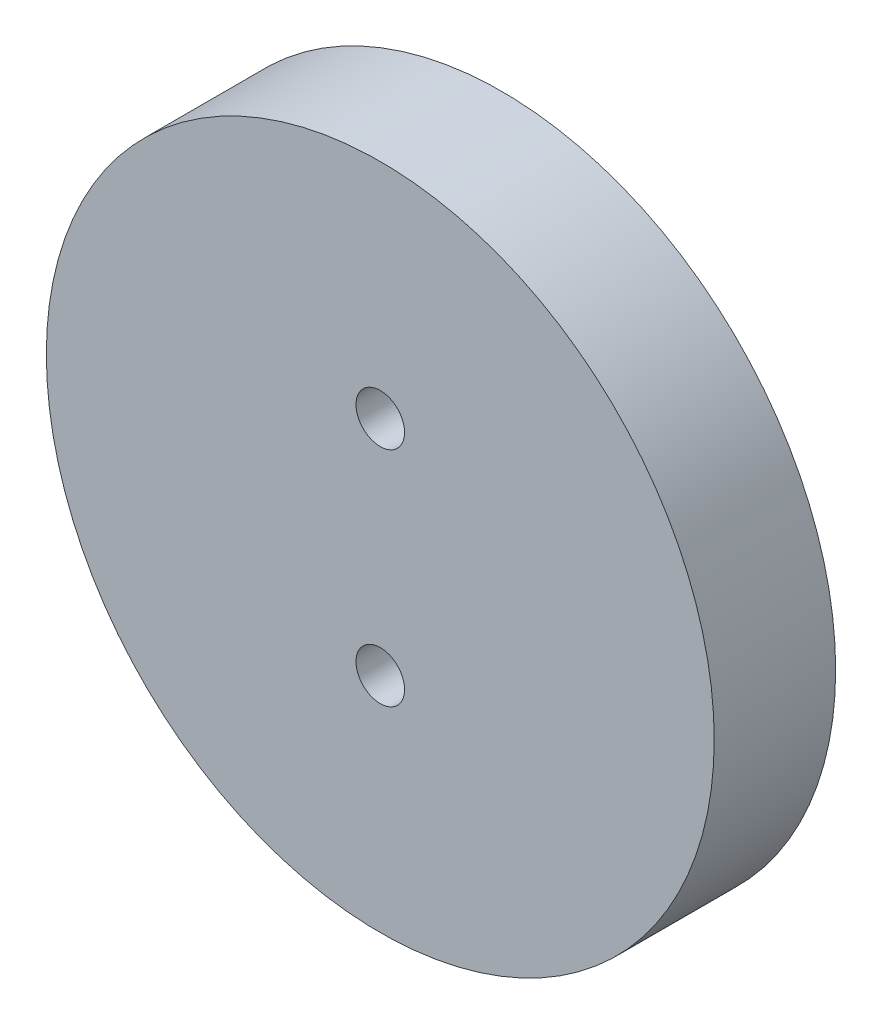
ISO-10303-21;
HEADER;
FILE_DESCRIPTION(('STEP AP214'),'2;1');
FILE_NAME('part.step','',(''),(''),'','','');
FILE_SCHEMA(('AUTOMOTIVE_DESIGN { 1 0 10303 214 1 1 1 1 }'));
ENDSEC;
DATA;
#1=APPLICATION_CONTEXT('core data for automotive mechanical design processes');
#2=APPLICATION_PROTOCOL_DEFINITION('international standard','automotive_design',2000,#1);
#3=PRODUCT_CONTEXT('',#1,'mechanical');
#4=PRODUCT('Part','Part','',(#3));
#5=PRODUCT_RELATED_PRODUCT_CATEGORY('part','',(#4));
#6=PRODUCT_DEFINITION_FORMATION('','',#4);
#7=PRODUCT_DEFINITION_CONTEXT('part definition',#1,'design');
#8=PRODUCT_DEFINITION('design','',#6,#7);
#9=PRODUCT_DEFINITION_SHAPE('','',#8);
#10=(LENGTH_UNIT() NAMED_UNIT(*) SI_UNIT(.MILLI.,.METRE.));
#11=(NAMED_UNIT(*) PLANE_ANGLE_UNIT() SI_UNIT($,.RADIAN.));
#12=(NAMED_UNIT(*) SI_UNIT($,.STERADIAN.) SOLID_ANGLE_UNIT());
#13=UNCERTAINTY_MEASURE_WITH_UNIT(LENGTH_MEASURE(1.E-05),#10,'distance_accuracy_value','');
#14=(GEOMETRIC_REPRESENTATION_CONTEXT(3) GLOBAL_UNCERTAINTY_ASSIGNED_CONTEXT((#13)) GLOBAL_UNIT_ASSIGNED_CONTEXT((#10,
#11,#12)) REPRESENTATION_CONTEXT('',''));
#15=CARTESIAN_POINT('',(0.,0.,0.));
#16=DIRECTION('',(0.,0.,1.));
#17=DIRECTION('',(1.,0.,0.));
#18=AXIS2_PLACEMENT_3D('',#15,#16,#17);
#19=CARTESIAN_POINT('',(0.,0.,12.7));
#20=DIRECTION('',(0.,0.,-1.));
#21=DIRECTION('',(-1.,0.,0.));
#22=AXIS2_PLACEMENT_3D('',#19,#20,#21);
#23=CYLINDRICAL_SURFACE('',#22,34.925);
#24=CARTESIAN_POINT('',(0.,0.,12.7));
#25=DIRECTION('',(0.,0.,1.));
#26=DIRECTION('',(1.,0.,0.));
#27=AXIS2_PLACEMENT_3D('',#24,#25,#26);
#28=CIRCLE('',#27,34.925);
#29=CARTESIAN_POINT('',(34.925,0.,12.7));
#30=VERTEX_POINT('',#29);
#31=EDGE_CURVE('E10',#30,#30,#28,.T.);
#32=ORIENTED_EDGE('',*,*,#31,.F.);
#33=EDGE_LOOP('',(#32));
#34=FACE_BOUND('',#33,.T.);
#35=CARTESIAN_POINT('',(0.,0.,0.));
#36=DIRECTION('',(0.,0.,1.));
#37=DIRECTION('',(1.,0.,0.));
#38=AXIS2_PLACEMENT_3D('',#35,#36,#37);
#39=CIRCLE('',#38,34.925);
#40=CARTESIAN_POINT('',(34.925,0.,0.));
#41=VERTEX_POINT('',#40);
#42=EDGE_CURVE('E37',#41,#41,#39,.T.);
#43=ORIENTED_EDGE('',*,*,#42,.T.);
#44=EDGE_LOOP('',(#43));
#45=FACE_BOUND('',#44,.T.);
#46=ADVANCED_FACE('F34',(#34,#45),#23,.T.);
#47=CARTESIAN_POINT('',(0.,0.,12.7));
#48=DIRECTION('',(0.,0.,1.));
#49=DIRECTION('',(1.,0.,0.));
#50=AXIS2_PLACEMENT_3D('',#47,#48,#49);
#51=PLANE('',#50);
#52=CARTESIAN_POINT('',(0.,11.6416666666667,12.7));
#53=DIRECTION('',(0.,0.,-1.));
#54=DIRECTION('',(-1.,0.,0.));
#55=AXIS2_PLACEMENT_3D('',#52,#53,#54);
#56=CIRCLE('',#55,2.54);
#57=CARTESIAN_POINT('',(-2.54,11.6416666666667,12.7));
#58=VERTEX_POINT('',#57);
#59=EDGE_CURVE('E57',#58,#58,#56,.T.);
#60=ORIENTED_EDGE('',*,*,#59,.T.);
#61=EDGE_LOOP('',(#60));
#62=FACE_BOUND('',#61,.T.);
#63=CARTESIAN_POINT('',(0.,-11.6416666666667,12.7));
#64=DIRECTION('',(0.,0.,-1.));
#65=DIRECTION('',(-1.,0.,0.));
#66=AXIS2_PLACEMENT_3D('',#63,#64,#65);
#67=CIRCLE('',#66,2.54);
#68=CARTESIAN_POINT('',(-2.54,-11.6416666666667,12.7));
#69=VERTEX_POINT('',#68);
#70=EDGE_CURVE('E44',#69,#69,#67,.T.);
#71=ORIENTED_EDGE('',*,*,#70,.T.);
#72=EDGE_LOOP('',(#71));
#73=FACE_BOUND('',#72,.T.);
#74=ORIENTED_EDGE('',*,*,#31,.T.);
#75=EDGE_LOOP('',(#74));
#76=FACE_BOUND('',#75,.T.);
#77=ADVANCED_FACE('F76',(#62,#73,#76),#51,.T.);
#78=CARTESIAN_POINT('',(0.,0.,0.));
#79=DIRECTION('',(0.,0.,1.));
#80=DIRECTION('',(1.,0.,0.));
#81=AXIS2_PLACEMENT_3D('',#78,#79,#80);
#82=PLANE('',#81);
#83=CARTESIAN_POINT('',(0.,11.6416666666667,0.));
#84=DIRECTION('',(0.,0.,-1.));
#85=DIRECTION('',(-1.,0.,0.));
#86=AXIS2_PLACEMENT_3D('',#83,#84,#85);
#87=CIRCLE('',#86,5.55625);
#88=CARTESIAN_POINT('',(-5.55625,11.6416666666667,0.));
#89=VERTEX_POINT('',#88);
#90=EDGE_CURVE('E66',#89,#89,#87,.T.);
#91=ORIENTED_EDGE('',*,*,#90,.F.);
#92=EDGE_LOOP('',(#91));
#93=FACE_BOUND('',#92,.T.);
#94=CARTESIAN_POINT('',(0.,-11.6416666666667,0.));
#95=DIRECTION('',(0.,0.,-1.));
#96=DIRECTION('',(-1.,0.,0.));
#97=AXIS2_PLACEMENT_3D('',#94,#95,#96);
#98=CIRCLE('',#97,5.55625);
#99=CARTESIAN_POINT('',(-5.55625,-11.6416666666667,0.));
#100=VERTEX_POINT('',#99);
#101=EDGE_CURVE('E54',#100,#100,#98,.T.);
#102=ORIENTED_EDGE('',*,*,#101,.F.);
#103=EDGE_LOOP('',(#102));
#104=FACE_BOUND('',#103,.T.);
#105=ORIENTED_EDGE('',*,*,#42,.F.);
#106=EDGE_LOOP('',(#105));
#107=FACE_BOUND('',#106,.T.);
#108=ADVANCED_FACE('F72',(#93,#104,#107),#82,.F.);
#109=CARTESIAN_POINT('',(0.,-11.6416666666667,0.));
#110=DIRECTION('',(0.,0.,-1.));
#111=DIRECTION('',(-1.,0.,0.));
#112=AXIS2_PLACEMENT_3D('',#109,#110,#111);
#113=CYLINDRICAL_SURFACE('',#112,2.54);
#114=ORIENTED_EDGE('',*,*,#70,.F.);
#115=EDGE_LOOP('',(#114));
#116=FACE_BOUND('',#115,.T.);
#117=CARTESIAN_POINT('',(0.,-11.6416666666667,6.35));
#118=DIRECTION('',(0.,0.,-1.));
#119=DIRECTION('',(-1.,0.,0.));
#120=AXIS2_PLACEMENT_3D('',#117,#118,#119);
#121=CIRCLE('',#120,2.54);
#122=CARTESIAN_POINT('',(-2.54,-11.6416666666667,6.35));
#123=VERTEX_POINT('',#122);
#124=EDGE_CURVE('E48',#123,#123,#121,.T.);
#125=ORIENTED_EDGE('',*,*,#124,.T.);
#126=EDGE_LOOP('',(#125));
#127=FACE_BOUND('',#126,.T.);
#128=ADVANCED_FACE('F75',(#116,#127),#113,.F.);
#129=CARTESIAN_POINT('',(2.54,-11.6416666666667,6.35));
#130=DIRECTION('',(0.,0.,1.));
#131=DIRECTION('',(1.,0.,0.));
#132=AXIS2_PLACEMENT_3D('',#129,#130,#131);
#133=PLANE('',#132);
#134=ORIENTED_EDGE('',*,*,#124,.F.);
#135=EDGE_LOOP('',(#134));
#136=FACE_BOUND('',#135,.T.);
#137=CARTESIAN_POINT('',(0.,-11.6416666666667,6.35));
#138=DIRECTION('',(0.,0.,-1.));
#139=DIRECTION('',(-1.,0.,0.));
#140=AXIS2_PLACEMENT_3D('',#137,#138,#139);
#141=CIRCLE('',#140,5.55625);
#142=CARTESIAN_POINT('',(-5.55625,-11.6416666666667,6.35));
#143=VERTEX_POINT('',#142);
#144=EDGE_CURVE('E51',#143,#143,#141,.T.);
#145=ORIENTED_EDGE('',*,*,#144,.T.);
#146=EDGE_LOOP('',(#145));
#147=FACE_BOUND('',#146,.T.);
#148=ADVANCED_FACE('F94',(#136,#147),#133,.F.);
#149=CARTESIAN_POINT('',(0.,-11.6416666666667,0.));
#150=DIRECTION('',(0.,0.,-1.));
#151=DIRECTION('',(-1.,0.,0.));
#152=AXIS2_PLACEMENT_3D('',#149,#150,#151);
#153=CYLINDRICAL_SURFACE('',#152,5.55625);
#154=ORIENTED_EDGE('',*,*,#144,.F.);
#155=EDGE_LOOP('',(#154));
#156=FACE_BOUND('',#155,.T.);
#157=ORIENTED_EDGE('',*,*,#101,.T.);
#158=EDGE_LOOP('',(#157));
#159=FACE_BOUND('',#158,.T.);
#160=ADVANCED_FACE('F98',(#156,#159),#153,.F.);
#161=CARTESIAN_POINT('',(0.,11.6416666666667,0.));
#162=DIRECTION('',(0.,0.,-1.));
#163=DIRECTION('',(-1.,0.,0.));
#164=AXIS2_PLACEMENT_3D('',#161,#162,#163);
#165=CYLINDRICAL_SURFACE('',#164,2.54);
#166=ORIENTED_EDGE('',*,*,#59,.F.);
#167=EDGE_LOOP('',(#166));
#168=FACE_BOUND('',#167,.T.);
#169=CARTESIAN_POINT('',(0.,11.6416666666667,6.35));
#170=DIRECTION('',(0.,0.,-1.));
#171=DIRECTION('',(-1.,0.,0.));
#172=AXIS2_PLACEMENT_3D('',#169,#170,#171);
#173=CIRCLE('',#172,2.54);
#174=CARTESIAN_POINT('',(-2.54,11.6416666666667,6.35));
#175=VERTEX_POINT('',#174);
#176=EDGE_CURVE('E60',#175,#175,#173,.T.);
#177=ORIENTED_EDGE('',*,*,#176,.T.);
#178=EDGE_LOOP('',(#177));
#179=FACE_BOUND('',#178,.T.);
#180=ADVANCED_FACE('F102',(#168,#179),#165,.F.);
#181=CARTESIAN_POINT('',(2.54,11.6416666666667,6.35));
#182=DIRECTION('',(0.,0.,1.));
#183=DIRECTION('',(1.,0.,0.));
#184=AXIS2_PLACEMENT_3D('',#181,#182,#183);
#185=PLANE('',#184);
#186=ORIENTED_EDGE('',*,*,#176,.F.);
#187=EDGE_LOOP('',(#186));
#188=FACE_BOUND('',#187,.T.);
#189=CARTESIAN_POINT('',(0.,11.6416666666667,6.35));
#190=DIRECTION('',(0.,0.,-1.));
#191=DIRECTION('',(-1.,0.,0.));
#192=AXIS2_PLACEMENT_3D('',#189,#190,#191);
#193=CIRCLE('',#192,5.55625);
#194=CARTESIAN_POINT('',(-5.55625,11.6416666666667,6.35));
#195=VERTEX_POINT('',#194);
#196=EDGE_CURVE('E63',#195,#195,#193,.T.);
#197=ORIENTED_EDGE('',*,*,#196,.T.);
#198=EDGE_LOOP('',(#197));
#199=FACE_BOUND('',#198,.T.);
#200=ADVANCED_FACE('F106',(#188,#199),#185,.F.);
#201=CARTESIAN_POINT('',(0.,11.6416666666667,0.));
#202=DIRECTION('',(0.,0.,-1.));
#203=DIRECTION('',(-1.,0.,0.));
#204=AXIS2_PLACEMENT_3D('',#201,#202,#203);
#205=CYLINDRICAL_SURFACE('',#204,5.55625);
#206=ORIENTED_EDGE('',*,*,#196,.F.);
#207=EDGE_LOOP('',(#206));
#208=FACE_BOUND('',#207,.T.);
#209=ORIENTED_EDGE('',*,*,#90,.T.);
#210=EDGE_LOOP('',(#209));
#211=FACE_BOUND('',#210,.T.);
#212=ADVANCED_FACE('F70',(#208,#211),#205,.F.);
#213=CLOSED_SHELL('',(#46,#77,#108,#128,#148,#160,#180,#200,#212));
#214=MANIFOLD_SOLID_BREP('B2',#213);
#215=ADVANCED_BREP_SHAPE_REPRESENTATION('',(#18,#214),#14);
#216=SHAPE_DEFINITION_REPRESENTATION(#9,#215);
ENDSEC;
END-ISO-10303-21;
